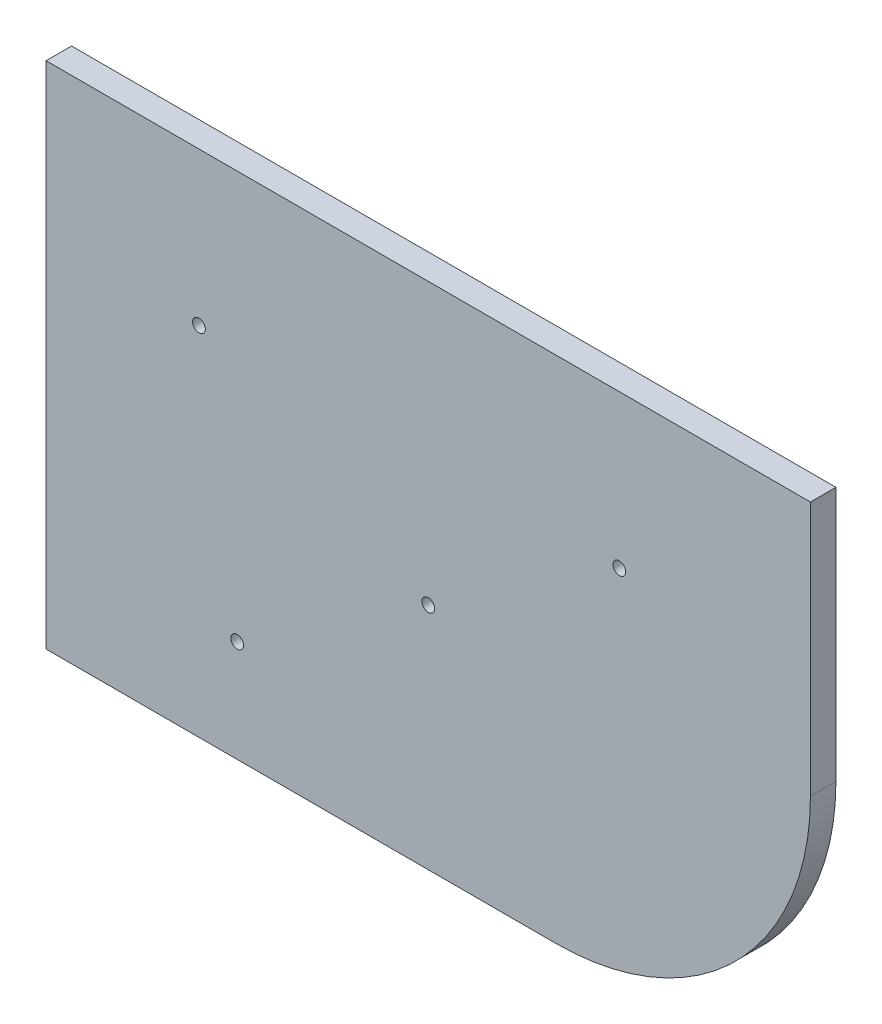
ISO-10303-21;
HEADER;
FILE_DESCRIPTION(('STEP AP214'),'2;1');
FILE_NAME('part.step','',(''),(''),'','','');
FILE_SCHEMA(('AUTOMOTIVE_DESIGN { 1 0 10303 214 1 1 1 1 }'));
ENDSEC;
DATA;
#1=APPLICATION_CONTEXT('core data for automotive mechanical design processes');
#2=APPLICATION_PROTOCOL_DEFINITION('international standard','automotive_design',2000,#1);
#3=PRODUCT_CONTEXT('',#1,'mechanical');
#4=PRODUCT('Part','Part','',(#3));
#5=PRODUCT_RELATED_PRODUCT_CATEGORY('part','',(#4));
#6=PRODUCT_DEFINITION_FORMATION('','',#4);
#7=PRODUCT_DEFINITION_CONTEXT('part definition',#1,'design');
#8=PRODUCT_DEFINITION('design','',#6,#7);
#9=PRODUCT_DEFINITION_SHAPE('','',#8);
#10=(LENGTH_UNIT() NAMED_UNIT(*) SI_UNIT(.MILLI.,.METRE.));
#11=(NAMED_UNIT(*) PLANE_ANGLE_UNIT() SI_UNIT($,.RADIAN.));
#12=(NAMED_UNIT(*) SI_UNIT($,.STERADIAN.) SOLID_ANGLE_UNIT());
#13=UNCERTAINTY_MEASURE_WITH_UNIT(LENGTH_MEASURE(1.E-05),#10,'distance_accuracy_value','');
#14=(GEOMETRIC_REPRESENTATION_CONTEXT(3) GLOBAL_UNCERTAINTY_ASSIGNED_CONTEXT((#13)) GLOBAL_UNIT_ASSIGNED_CONTEXT((#10,
#11,#12)) REPRESENTATION_CONTEXT('',''));
#15=CARTESIAN_POINT('',(0.,0.,0.));
#16=DIRECTION('',(0.,0.,1.));
#17=DIRECTION('',(1.,0.,0.));
#18=AXIS2_PLACEMENT_3D('',#15,#16,#17);
#19=CARTESIAN_POINT('',(0.,200.,-5.));
#20=DIRECTION('',(0.,-1.,0.));
#21=DIRECTION('',(0.,0.,1.));
#22=AXIS2_PLACEMENT_3D('',#19,#20,#21);
#23=PLANE('',#22);
#24=DIRECTION('',(-1.,0.,0.));
#25=VECTOR('',#24,1.);
#26=CARTESIAN_POINT('',(0.,200.,5.));
#27=LINE('',#26,#25);
#28=CARTESIAN_POINT('',(300.,200.,5.));
#29=VERTEX_POINT('',#28);
#30=CARTESIAN_POINT('',(0.,200.,5.));
#31=VERTEX_POINT('',#30);
#32=EDGE_CURVE('E116',#29,#31,#27,.T.);
#33=ORIENTED_EDGE('',*,*,#32,.F.);
#34=DIRECTION('',(0.,0.,1.));
#35=VECTOR('',#34,1.);
#36=CARTESIAN_POINT('',(300.,200.,-5.));
#37=LINE('',#36,#35);
#38=CARTESIAN_POINT('',(300.,200.,-5.));
#39=VERTEX_POINT('',#38);
#40=EDGE_CURVE('E115',#39,#29,#37,.T.);
#41=ORIENTED_EDGE('',*,*,#40,.F.);
#42=DIRECTION('',(-1.,0.,0.));
#43=VECTOR('',#42,1.);
#44=CARTESIAN_POINT('',(0.,200.,-5.));
#45=LINE('',#44,#43);
#46=CARTESIAN_POINT('',(0.,200.,-5.));
#47=VERTEX_POINT('',#46);
#48=EDGE_CURVE('E110',#39,#47,#45,.T.);
#49=ORIENTED_EDGE('',*,*,#48,.T.);
#50=DIRECTION('',(0.,0.,1.));
#51=VECTOR('',#50,1.);
#52=CARTESIAN_POINT('',(0.,200.,-5.));
#53=LINE('',#52,#51);
#54=EDGE_CURVE('E11',#47,#31,#53,.T.);
#55=ORIENTED_EDGE('',*,*,#54,.T.);
#56=EDGE_LOOP('',(#33,#41,#49,#55));
#57=FACE_BOUND('',#56,.T.);
#58=ADVANCED_FACE('F41',(#57),#23,.F.);
#59=CARTESIAN_POINT('',(0.,200.,-5.));
#60=DIRECTION('',(1.,0.,0.));
#61=DIRECTION('',(0.,1.,0.));
#62=AXIS2_PLACEMENT_3D('',#59,#60,#61);
#63=PLANE('',#62);
#64=DIRECTION('',(0.,-1.,0.));
#65=VECTOR('',#64,1.);
#66=CARTESIAN_POINT('',(0.,200.,5.));
#67=LINE('',#66,#65);
#68=CARTESIAN_POINT('',(0.,0.,5.));
#69=VERTEX_POINT('',#68);
#70=EDGE_CURVE('E118',#31,#69,#67,.T.);
#71=ORIENTED_EDGE('',*,*,#70,.F.);
#72=ORIENTED_EDGE('',*,*,#54,.F.);
#73=DIRECTION('',(0.,-1.,0.));
#74=VECTOR('',#73,1.);
#75=CARTESIAN_POINT('',(0.,200.,-5.));
#76=LINE('',#75,#74);
#77=CARTESIAN_POINT('',(0.,0.,-5.));
#78=VERTEX_POINT('',#77);
#79=EDGE_CURVE('E86',#47,#78,#76,.T.);
#80=ORIENTED_EDGE('',*,*,#79,.T.);
#81=DIRECTION('',(0.,0.,1.));
#82=VECTOR('',#81,1.);
#83=CARTESIAN_POINT('',(0.,0.,-5.));
#84=LINE('',#83,#82);
#85=EDGE_CURVE('E49',#78,#69,#84,.T.);
#86=ORIENTED_EDGE('',*,*,#85,.T.);
#87=EDGE_LOOP('',(#71,#72,#80,#86));
#88=FACE_BOUND('',#87,.T.);
#89=ADVANCED_FACE('F128',(#88),#63,.F.);
#90=CARTESIAN_POINT('',(200.,0.,-5.));
#91=DIRECTION('',(0.,1.,0.));
#92=DIRECTION('',(-1.,0.,0.));
#93=AXIS2_PLACEMENT_3D('',#90,#91,#92);
#94=PLANE('',#93);
#95=DIRECTION('',(1.,0.,0.));
#96=VECTOR('',#95,1.);
#97=CARTESIAN_POINT('',(200.,0.,5.));
#98=LINE('',#97,#96);
#99=CARTESIAN_POINT('',(200.,0.,5.));
#100=VERTEX_POINT('',#99);
#101=EDGE_CURVE('E122',#69,#100,#98,.T.);
#102=ORIENTED_EDGE('',*,*,#101,.F.);
#103=ORIENTED_EDGE('',*,*,#85,.F.);
#104=DIRECTION('',(1.,0.,0.));
#105=VECTOR('',#104,1.);
#106=CARTESIAN_POINT('',(200.,0.,-5.));
#107=LINE('',#106,#105);
#108=CARTESIAN_POINT('',(200.,0.,-5.));
#109=VERTEX_POINT('',#108);
#110=EDGE_CURVE('E95',#78,#109,#107,.T.);
#111=ORIENTED_EDGE('',*,*,#110,.T.);
#112=DIRECTION('',(0.,0.,1.));
#113=VECTOR('',#112,1.);
#114=CARTESIAN_POINT('',(200.,0.,-5.));
#115=LINE('',#114,#113);
#116=EDGE_CURVE('E100',#109,#100,#115,.T.);
#117=ORIENTED_EDGE('',*,*,#116,.T.);
#118=EDGE_LOOP('',(#102,#103,#111,#117));
#119=FACE_BOUND('',#118,.T.);
#120=ADVANCED_FACE('F107',(#119),#94,.F.);
#121=CARTESIAN_POINT('',(200.,100.,-5.));
#122=DIRECTION('',(0.,0.,1.));
#123=DIRECTION('',(-1.,0.,0.));
#124=AXIS2_PLACEMENT_3D('',#121,#122,#123);
#125=CYLINDRICAL_SURFACE('',#124,100.);
#126=CARTESIAN_POINT('',(200.,100.,5.));
#127=DIRECTION('',(0.,0.,1.));
#128=DIRECTION('',(-1.,0.,0.));
#129=AXIS2_PLACEMENT_3D('',#126,#127,#128);
#130=CIRCLE('',#129,100.);
#131=CARTESIAN_POINT('',(300.,100.,5.));
#132=VERTEX_POINT('',#131);
#133=EDGE_CURVE('E102',#100,#132,#130,.T.);
#134=ORIENTED_EDGE('',*,*,#133,.F.);
#135=ORIENTED_EDGE('',*,*,#116,.F.);
#136=CARTESIAN_POINT('',(200.,100.,-5.));
#137=DIRECTION('',(0.,0.,1.));
#138=DIRECTION('',(-1.,0.,0.));
#139=AXIS2_PLACEMENT_3D('',#136,#137,#138);
#140=CIRCLE('',#139,100.);
#141=CARTESIAN_POINT('',(300.,100.,-5.));
#142=VERTEX_POINT('',#141);
#143=EDGE_CURVE('E91',#109,#142,#140,.T.);
#144=ORIENTED_EDGE('',*,*,#143,.T.);
#145=DIRECTION('',(0.,0.,1.));
#146=VECTOR('',#145,1.);
#147=CARTESIAN_POINT('',(300.,100.,-5.));
#148=LINE('',#147,#146);
#149=EDGE_CURVE('E105',#142,#132,#148,.T.);
#150=ORIENTED_EDGE('',*,*,#149,.T.);
#151=EDGE_LOOP('',(#134,#135,#144,#150));
#152=FACE_BOUND('',#151,.T.);
#153=ADVANCED_FACE('F101',(#152),#125,.T.);
#154=CARTESIAN_POINT('',(300.,200.,-5.));
#155=DIRECTION('',(-1.,0.,0.));
#156=DIRECTION('',(0.,-1.,0.));
#157=AXIS2_PLACEMENT_3D('',#154,#155,#156);
#158=PLANE('',#157);
#159=DIRECTION('',(0.,1.,0.));
#160=VECTOR('',#159,1.);
#161=CARTESIAN_POINT('',(300.,200.,5.));
#162=LINE('',#161,#160);
#163=EDGE_CURVE('E74',#132,#29,#162,.T.);
#164=ORIENTED_EDGE('',*,*,#163,.F.);
#165=ORIENTED_EDGE('',*,*,#149,.F.);
#166=DIRECTION('',(0.,1.,0.));
#167=VECTOR('',#166,1.);
#168=CARTESIAN_POINT('',(300.,200.,-5.));
#169=LINE('',#168,#167);
#170=EDGE_CURVE('E57',#142,#39,#169,.T.);
#171=ORIENTED_EDGE('',*,*,#170,.T.);
#172=ORIENTED_EDGE('',*,*,#40,.T.);
#173=EDGE_LOOP('',(#164,#165,#171,#172));
#174=FACE_BOUND('',#173,.T.);
#175=ADVANCED_FACE('F181',(#174),#158,.F.);
#176=CARTESIAN_POINT('',(200.,100.,-5.));
#177=DIRECTION('',(0.,0.,1.));
#178=DIRECTION('',(-1.,0.,0.));
#179=AXIS2_PLACEMENT_3D('',#176,#177,#178);
#180=PLANE('',#179);
#181=ORIENTED_EDGE('',*,*,#48,.F.);
#182=ORIENTED_EDGE('',*,*,#170,.F.);
#183=ORIENTED_EDGE('',*,*,#143,.F.);
#184=ORIENTED_EDGE('',*,*,#110,.F.);
#185=ORIENTED_EDGE('',*,*,#79,.F.);
#186=EDGE_LOOP('',(#181,#182,#183,#184,#185));
#187=FACE_BOUND('',#186,.T.);
#188=ADVANCED_FACE('F93',(#187),#180,.F.);
#189=CARTESIAN_POINT('',(200.,100.,5.));
#190=DIRECTION('',(0.,0.,1.));
#191=DIRECTION('',(-1.,0.,0.));
#192=AXIS2_PLACEMENT_3D('',#189,#190,#191);
#193=PLANE('',#192);
#194=CARTESIAN_POINT('',(225.,140.,5.));
#195=DIRECTION('',(0.,0.,-1.));
#196=DIRECTION('',(-1.,0.,0.));
#197=AXIS2_PLACEMENT_3D('',#194,#195,#196);
#198=CIRCLE('',#197,2.5);
#199=CARTESIAN_POINT('',(222.5,140.,5.));
#200=VERTEX_POINT('',#199);
#201=EDGE_CURVE('E153',#200,#200,#198,.T.);
#202=ORIENTED_EDGE('',*,*,#201,.T.);
#203=EDGE_LOOP('',(#202));
#204=FACE_BOUND('',#203,.T.);
#205=CARTESIAN_POINT('',(150.,90.,5.));
#206=DIRECTION('',(0.,0.,-1.));
#207=DIRECTION('',(-1.,0.,0.));
#208=AXIS2_PLACEMENT_3D('',#205,#206,#207);
#209=CIRCLE('',#208,2.5);
#210=CARTESIAN_POINT('',(147.5,90.,5.));
#211=VERTEX_POINT('',#210);
#212=EDGE_CURVE('E150',#211,#211,#209,.T.);
#213=ORIENTED_EDGE('',*,*,#212,.T.);
#214=EDGE_LOOP('',(#213));
#215=FACE_BOUND('',#214,.T.);
#216=CARTESIAN_POINT('',(60.,140.,5.));
#217=DIRECTION('',(0.,0.,-1.));
#218=DIRECTION('',(-1.,0.,0.));
#219=AXIS2_PLACEMENT_3D('',#216,#217,#218);
#220=CIRCLE('',#219,2.5);
#221=CARTESIAN_POINT('',(57.5,140.,5.));
#222=VERTEX_POINT('',#221);
#223=EDGE_CURVE('E144',#222,#222,#220,.T.);
#224=ORIENTED_EDGE('',*,*,#223,.T.);
#225=EDGE_LOOP('',(#224));
#226=FACE_BOUND('',#225,.T.);
#227=CARTESIAN_POINT('',(75.,40.,5.));
#228=DIRECTION('',(0.,0.,-1.));
#229=DIRECTION('',(-1.,0.,0.));
#230=AXIS2_PLACEMENT_3D('',#227,#228,#229);
#231=CIRCLE('',#230,2.5);
#232=CARTESIAN_POINT('',(72.5,40.,5.));
#233=VERTEX_POINT('',#232);
#234=EDGE_CURVE('E138',#233,#233,#231,.T.);
#235=ORIENTED_EDGE('',*,*,#234,.T.);
#236=EDGE_LOOP('',(#235));
#237=FACE_BOUND('',#236,.T.);
#238=ORIENTED_EDGE('',*,*,#32,.T.);
#239=ORIENTED_EDGE('',*,*,#70,.T.);
#240=ORIENTED_EDGE('',*,*,#101,.T.);
#241=ORIENTED_EDGE('',*,*,#133,.T.);
#242=ORIENTED_EDGE('',*,*,#163,.T.);
#243=EDGE_LOOP('',(#238,#239,#240,#241,#242));
#244=FACE_BOUND('',#243,.T.);
#245=ADVANCED_FACE('F129',(#204,#215,#226,#237,#244),#193,.T.);
#246=CARTESIAN_POINT('',(75.,40.,0.));
#247=DIRECTION('',(0.,0.,1.));
#248=DIRECTION('',(-1.,0.,0.));
#249=AXIS2_PLACEMENT_3D('',#246,#247,#248);
#250=CYLINDRICAL_SURFACE('',#249,2.5);
#251=CARTESIAN_POINT('',(75.,40.,0.));
#252=DIRECTION('',(0.,0.,-1.));
#253=DIRECTION('',(-1.,0.,0.));
#254=AXIS2_PLACEMENT_3D('',#251,#252,#253);
#255=CIRCLE('',#254,2.5);
#256=CARTESIAN_POINT('',(72.5,40.,0.));
#257=VERTEX_POINT('',#256);
#258=EDGE_CURVE('E135',#257,#257,#255,.T.);
#259=ORIENTED_EDGE('',*,*,#258,.T.);
#260=EDGE_LOOP('',(#259));
#261=FACE_BOUND('',#260,.T.);
#262=ORIENTED_EDGE('',*,*,#234,.F.);
#263=EDGE_LOOP('',(#262));
#264=FACE_BOUND('',#263,.T.);
#265=ADVANCED_FACE('F186',(#261,#264),#250,.F.);
#266=CARTESIAN_POINT('',(75.,40.,0.));
#267=DIRECTION('',(0.,0.,1.));
#268=DIRECTION('',(-1.,0.,0.));
#269=AXIS2_PLACEMENT_3D('',#266,#267,#268);
#270=PLANE('',#269);
#271=ORIENTED_EDGE('',*,*,#258,.F.);
#272=EDGE_LOOP('',(#271));
#273=FACE_BOUND('',#272,.T.);
#274=ADVANCED_FACE('F190',(#273),#270,.T.);
#275=CARTESIAN_POINT('',(60.,140.,0.));
#276=DIRECTION('',(0.,0.,1.));
#277=DIRECTION('',(-1.,0.,0.));
#278=AXIS2_PLACEMENT_3D('',#275,#276,#277);
#279=CYLINDRICAL_SURFACE('',#278,2.5);
#280=CARTESIAN_POINT('',(60.,140.,0.));
#281=DIRECTION('',(0.,0.,-1.));
#282=DIRECTION('',(-1.,0.,0.));
#283=AXIS2_PLACEMENT_3D('',#280,#281,#282);
#284=CIRCLE('',#283,2.5);
#285=CARTESIAN_POINT('',(57.5,140.,0.));
#286=VERTEX_POINT('',#285);
#287=EDGE_CURVE('E141',#286,#286,#284,.T.);
#288=ORIENTED_EDGE('',*,*,#287,.T.);
#289=EDGE_LOOP('',(#288));
#290=FACE_BOUND('',#289,.T.);
#291=ORIENTED_EDGE('',*,*,#223,.F.);
#292=EDGE_LOOP('',(#291));
#293=FACE_BOUND('',#292,.T.);
#294=ADVANCED_FACE('F193',(#290,#293),#279,.F.);
#295=CARTESIAN_POINT('',(60.,140.,0.));
#296=DIRECTION('',(0.,0.,1.));
#297=DIRECTION('',(-1.,0.,0.));
#298=AXIS2_PLACEMENT_3D('',#295,#296,#297);
#299=PLANE('',#298);
#300=ORIENTED_EDGE('',*,*,#287,.F.);
#301=EDGE_LOOP('',(#300));
#302=FACE_BOUND('',#301,.T.);
#303=ADVANCED_FACE('F198',(#302),#299,.T.);
#304=CARTESIAN_POINT('',(150.,90.,0.));
#305=DIRECTION('',(0.,0.,1.));
#306=DIRECTION('',(-1.,0.,0.));
#307=AXIS2_PLACEMENT_3D('',#304,#305,#306);
#308=CYLINDRICAL_SURFACE('',#307,2.5);
#309=CARTESIAN_POINT('',(150.,90.,0.));
#310=DIRECTION('',(0.,0.,-1.));
#311=DIRECTION('',(-1.,0.,0.));
#312=AXIS2_PLACEMENT_3D('',#309,#310,#311);
#313=CIRCLE('',#312,2.5);
#314=CARTESIAN_POINT('',(147.5,90.,0.));
#315=VERTEX_POINT('',#314);
#316=EDGE_CURVE('E147',#315,#315,#313,.T.);
#317=ORIENTED_EDGE('',*,*,#316,.T.);
#318=EDGE_LOOP('',(#317));
#319=FACE_BOUND('',#318,.T.);
#320=ORIENTED_EDGE('',*,*,#212,.F.);
#321=EDGE_LOOP('',(#320));
#322=FACE_BOUND('',#321,.T.);
#323=ADVANCED_FACE('F201',(#319,#322),#308,.F.);
#324=CARTESIAN_POINT('',(150.,90.,0.));
#325=DIRECTION('',(0.,0.,1.));
#326=DIRECTION('',(-1.,0.,0.));
#327=AXIS2_PLACEMENT_3D('',#324,#325,#326);
#328=PLANE('',#327);
#329=ORIENTED_EDGE('',*,*,#316,.F.);
#330=EDGE_LOOP('',(#329));
#331=FACE_BOUND('',#330,.T.);
#332=ADVANCED_FACE('F168',(#331),#328,.T.);
#333=CARTESIAN_POINT('',(225.,140.,0.));
#334=DIRECTION('',(0.,0.,1.));
#335=DIRECTION('',(-1.,0.,0.));
#336=AXIS2_PLACEMENT_3D('',#333,#334,#335);
#337=CYLINDRICAL_SURFACE('',#336,2.5);
#338=CARTESIAN_POINT('',(225.,140.,0.));
#339=DIRECTION('',(0.,0.,-1.));
#340=DIRECTION('',(-1.,0.,0.));
#341=AXIS2_PLACEMENT_3D('',#338,#339,#340);
#342=CIRCLE('',#341,2.5);
#343=CARTESIAN_POINT('',(222.5,140.,0.));
#344=VERTEX_POINT('',#343);
#345=EDGE_CURVE('E119',#344,#344,#342,.T.);
#346=ORIENTED_EDGE('',*,*,#345,.T.);
#347=EDGE_LOOP('',(#346));
#348=FACE_BOUND('',#347,.T.);
#349=ORIENTED_EDGE('',*,*,#201,.F.);
#350=EDGE_LOOP('',(#349));
#351=FACE_BOUND('',#350,.T.);
#352=ADVANCED_FACE('F159',(#348,#351),#337,.F.);
#353=CARTESIAN_POINT('',(225.,140.,0.));
#354=DIRECTION('',(0.,0.,1.));
#355=DIRECTION('',(-1.,0.,0.));
#356=AXIS2_PLACEMENT_3D('',#353,#354,#355);
#357=PLANE('',#356);
#358=ORIENTED_EDGE('',*,*,#345,.F.);
#359=EDGE_LOOP('',(#358));
#360=FACE_BOUND('',#359,.T.);
#361=ADVANCED_FACE('F162',(#360),#357,.T.);
#362=CLOSED_SHELL('',(#58,#89,#120,#153,#175,#188,#245,#265,#274,#294,#303,#323,#332,#352,#361));
#363=MANIFOLD_SOLID_BREP('B2',#362);
#364=ADVANCED_BREP_SHAPE_REPRESENTATION('',(#18,#363),#14);
#365=SHAPE_DEFINITION_REPRESENTATION(#9,#364);
ENDSEC;
END-ISO-10303-21;
